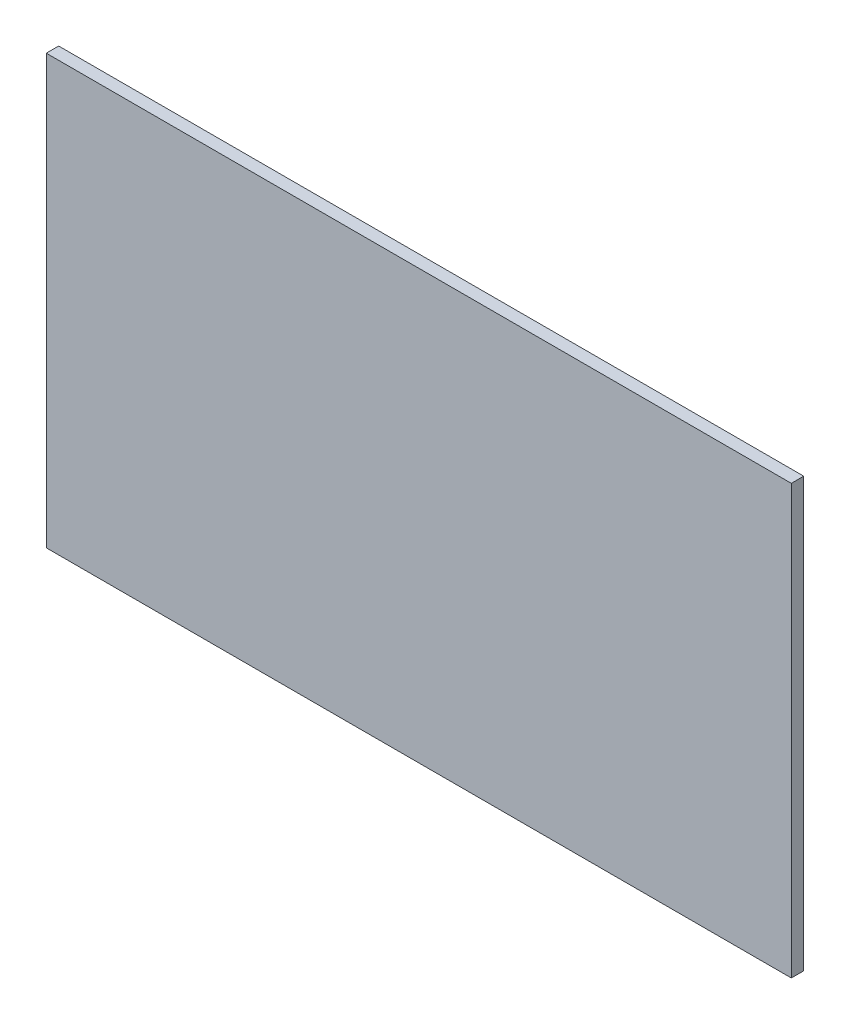
ISO-10303-21;
HEADER;
FILE_DESCRIPTION(('STEP AP214'),'2;1');
FILE_NAME('part.step','',(''),(''),'','','');
FILE_SCHEMA(('AUTOMOTIVE_DESIGN { 1 0 10303 214 1 1 1 1 }'));
ENDSEC;
DATA;
#1=APPLICATION_CONTEXT('core data for automotive mechanical design processes');
#2=APPLICATION_PROTOCOL_DEFINITION('international standard','automotive_design',2000,#1);
#3=PRODUCT_CONTEXT('',#1,'mechanical');
#4=PRODUCT('Part','Part','',(#3));
#5=PRODUCT_RELATED_PRODUCT_CATEGORY('part','',(#4));
#6=PRODUCT_DEFINITION_FORMATION('','',#4);
#7=PRODUCT_DEFINITION_CONTEXT('part definition',#1,'design');
#8=PRODUCT_DEFINITION('design','',#6,#7);
#9=PRODUCT_DEFINITION_SHAPE('','',#8);
#10=(LENGTH_UNIT() NAMED_UNIT(*) SI_UNIT(.MILLI.,.METRE.));
#11=(NAMED_UNIT(*) PLANE_ANGLE_UNIT() SI_UNIT($,.RADIAN.));
#12=(NAMED_UNIT(*) SI_UNIT($,.STERADIAN.) SOLID_ANGLE_UNIT());
#13=UNCERTAINTY_MEASURE_WITH_UNIT(LENGTH_MEASURE(1.E-05),#10,'distance_accuracy_value','');
#14=(GEOMETRIC_REPRESENTATION_CONTEXT(3) GLOBAL_UNCERTAINTY_ASSIGNED_CONTEXT((#13)) GLOBAL_UNIT_ASSIGNED_CONTEXT((#10,
#11,#12)) REPRESENTATION_CONTEXT('',''));
#15=CARTESIAN_POINT('',(0.,0.,0.));
#16=DIRECTION('',(0.,0.,1.));
#17=DIRECTION('',(1.,0.,0.));
#18=AXIS2_PLACEMENT_3D('',#15,#16,#17);
#19=CARTESIAN_POINT('',(0.,0.275,0.));
#20=DIRECTION('',(0.,0.,1.));
#21=DIRECTION('',(1.,0.,0.));
#22=AXIS2_PLACEMENT_3D('',#19,#20,#21);
#23=PLANE('',#22);
#24=DIRECTION('',(-1.,0.,0.));
#25=VECTOR('',#24,1.);
#26=CARTESIAN_POINT('',(3.,2.,0.));
#27=LINE('',#26,#25);
#28=CARTESIAN_POINT('',(3.,2.,0.));
#29=VERTEX_POINT('',#28);
#30=CARTESIAN_POINT('',(-3.,2.,0.));
#31=VERTEX_POINT('',#30);
#32=EDGE_CURVE('E78',#29,#31,#27,.T.);
#33=ORIENTED_EDGE('',*,*,#32,.F.);
#34=DIRECTION('',(0.,1.,0.));
#35=VECTOR('',#34,1.);
#36=CARTESIAN_POINT('',(3.,-1.45,0.));
#37=LINE('',#36,#35);
#38=CARTESIAN_POINT('',(3.,-1.45,0.));
#39=VERTEX_POINT('',#38);
#40=EDGE_CURVE('E54',#39,#29,#37,.T.);
#41=ORIENTED_EDGE('',*,*,#40,.F.);
#42=DIRECTION('',(1.,0.,0.));
#43=VECTOR('',#42,1.);
#44=CARTESIAN_POINT('',(-3.,-1.45,0.));
#45=LINE('',#44,#43);
#46=CARTESIAN_POINT('',(-3.,-1.45,0.));
#47=VERTEX_POINT('',#46);
#48=EDGE_CURVE('E56',#47,#39,#45,.T.);
#49=ORIENTED_EDGE('',*,*,#48,.F.);
#50=DIRECTION('',(0.,1.,0.));
#51=VECTOR('',#50,1.);
#52=CARTESIAN_POINT('',(-3.,2.,0.));
#53=LINE('',#52,#51);
#54=EDGE_CURVE('E19',#31,#47,#53,.F.);
#55=ORIENTED_EDGE('',*,*,#54,.F.);
#56=EDGE_LOOP('',(#33,#41,#49,#55));
#57=FACE_BOUND('',#56,.T.);
#58=ADVANCED_FACE('F16',(#57),#23,.F.);
#59=CARTESIAN_POINT('',(-3.,2.,0.));
#60=DIRECTION('',(-1.,0.,0.));
#61=DIRECTION('',(0.,0.,1.));
#62=AXIS2_PLACEMENT_3D('',#59,#60,#61);
#63=PLANE('',#62);
#64=DIRECTION('',(0.,1.,0.));
#65=VECTOR('',#64,1.);
#66=CARTESIAN_POINT('',(-3.,0.275,0.1));
#67=LINE('',#66,#65);
#68=CARTESIAN_POINT('',(-3.,2.,0.1));
#69=VERTEX_POINT('',#68);
#70=CARTESIAN_POINT('',(-3.,-1.45,0.1));
#71=VERTEX_POINT('',#70);
#72=EDGE_CURVE('E82',#69,#71,#67,.F.);
#73=ORIENTED_EDGE('',*,*,#72,.F.);
#74=DIRECTION('',(0.,0.,1.));
#75=VECTOR('',#74,1.);
#76=CARTESIAN_POINT('',(-3.,2.,0.));
#77=LINE('',#76,#75);
#78=EDGE_CURVE('E67',#31,#69,#77,.T.);
#79=ORIENTED_EDGE('',*,*,#78,.F.);
#80=ORIENTED_EDGE('',*,*,#54,.T.);
#81=DIRECTION('',(0.,0.,-1.));
#82=VECTOR('',#81,1.);
#83=CARTESIAN_POINT('',(-3.,-1.45,0.));
#84=LINE('',#83,#82);
#85=EDGE_CURVE('E62',#71,#47,#84,.T.);
#86=ORIENTED_EDGE('',*,*,#85,.F.);
#87=EDGE_LOOP('',(#73,#79,#80,#86));
#88=FACE_BOUND('',#87,.T.);
#89=ADVANCED_FACE('F64',(#88),#63,.T.);
#90=CARTESIAN_POINT('',(-3.,-1.45,0.));
#91=DIRECTION('',(0.,-1.,0.));
#92=DIRECTION('',(0.,0.,-1.));
#93=AXIS2_PLACEMENT_3D('',#90,#91,#92);
#94=PLANE('',#93);
#95=DIRECTION('',(1.,0.,0.));
#96=VECTOR('',#95,1.);
#97=CARTESIAN_POINT('',(0.,-1.45,0.1));
#98=LINE('',#97,#96);
#99=CARTESIAN_POINT('',(3.,-1.45,0.1));
#100=VERTEX_POINT('',#99);
#101=EDGE_CURVE('E71',#71,#100,#98,.T.);
#102=ORIENTED_EDGE('',*,*,#101,.F.);
#103=ORIENTED_EDGE('',*,*,#85,.T.);
#104=ORIENTED_EDGE('',*,*,#48,.T.);
#105=DIRECTION('',(0.,0.,-1.));
#106=VECTOR('',#105,1.);
#107=CARTESIAN_POINT('',(3.,-1.45,0.));
#108=LINE('',#107,#106);
#109=EDGE_CURVE('E74',#100,#39,#108,.T.);
#110=ORIENTED_EDGE('',*,*,#109,.F.);
#111=EDGE_LOOP('',(#102,#103,#104,#110));
#112=FACE_BOUND('',#111,.T.);
#113=ADVANCED_FACE('F69',(#112),#94,.T.);
#114=CARTESIAN_POINT('',(3.,-1.45,0.));
#115=DIRECTION('',(1.,0.,0.));
#116=DIRECTION('',(0.,0.,-1.));
#117=AXIS2_PLACEMENT_3D('',#114,#115,#116);
#118=PLANE('',#117);
#119=DIRECTION('',(0.,1.,0.));
#120=VECTOR('',#119,1.);
#121=CARTESIAN_POINT('',(3.,0.275,0.1));
#122=LINE('',#121,#120);
#123=CARTESIAN_POINT('',(3.,2.,0.1));
#124=VERTEX_POINT('',#123);
#125=EDGE_CURVE('E25',#100,#124,#122,.T.);
#126=ORIENTED_EDGE('',*,*,#125,.F.);
#127=ORIENTED_EDGE('',*,*,#109,.T.);
#128=ORIENTED_EDGE('',*,*,#40,.T.);
#129=DIRECTION('',(0.,0.,1.));
#130=VECTOR('',#129,1.);
#131=CARTESIAN_POINT('',(3.,2.,0.));
#132=LINE('',#131,#130);
#133=EDGE_CURVE('E34',#124,#29,#132,.F.);
#134=ORIENTED_EDGE('',*,*,#133,.F.);
#135=EDGE_LOOP('',(#126,#127,#128,#134));
#136=FACE_BOUND('',#135,.T.);
#137=ADVANCED_FACE('F88',(#136),#118,.T.);
#138=CARTESIAN_POINT('',(3.,2.,0.));
#139=DIRECTION('',(0.,1.,0.));
#140=DIRECTION('',(-1.,0.,0.));
#141=AXIS2_PLACEMENT_3D('',#138,#139,#140);
#142=PLANE('',#141);
#143=DIRECTION('',(1.,0.,0.));
#144=VECTOR('',#143,1.);
#145=CARTESIAN_POINT('',(0.,2.,0.1));
#146=LINE('',#145,#144);
#147=EDGE_CURVE('E11',#124,#69,#146,.F.);
#148=ORIENTED_EDGE('',*,*,#147,.F.);
#149=ORIENTED_EDGE('',*,*,#133,.T.);
#150=ORIENTED_EDGE('',*,*,#32,.T.);
#151=ORIENTED_EDGE('',*,*,#78,.T.);
#152=EDGE_LOOP('',(#148,#149,#150,#151));
#153=FACE_BOUND('',#152,.T.);
#154=ADVANCED_FACE('F90',(#153),#142,.T.);
#155=CARTESIAN_POINT('',(0.,0.275,0.1));
#156=DIRECTION('',(0.,0.,1.));
#157=DIRECTION('',(1.,0.,0.));
#158=AXIS2_PLACEMENT_3D('',#155,#156,#157);
#159=PLANE('',#158);
#160=ORIENTED_EDGE('',*,*,#125,.T.);
#161=ORIENTED_EDGE('',*,*,#147,.T.);
#162=ORIENTED_EDGE('',*,*,#72,.T.);
#163=ORIENTED_EDGE('',*,*,#101,.T.);
#164=EDGE_LOOP('',(#160,#161,#162,#163));
#165=FACE_BOUND('',#164,.T.);
#166=ADVANCED_FACE('F87',(#165),#159,.T.);
#167=CLOSED_SHELL('',(#58,#89,#113,#137,#154,#166));
#168=MANIFOLD_SOLID_BREP('B1',#167);
#169=ADVANCED_BREP_SHAPE_REPRESENTATION('',(#18,#168),#14);
#170=SHAPE_DEFINITION_REPRESENTATION(#9,#169);
ENDSEC;
END-ISO-10303-21;
